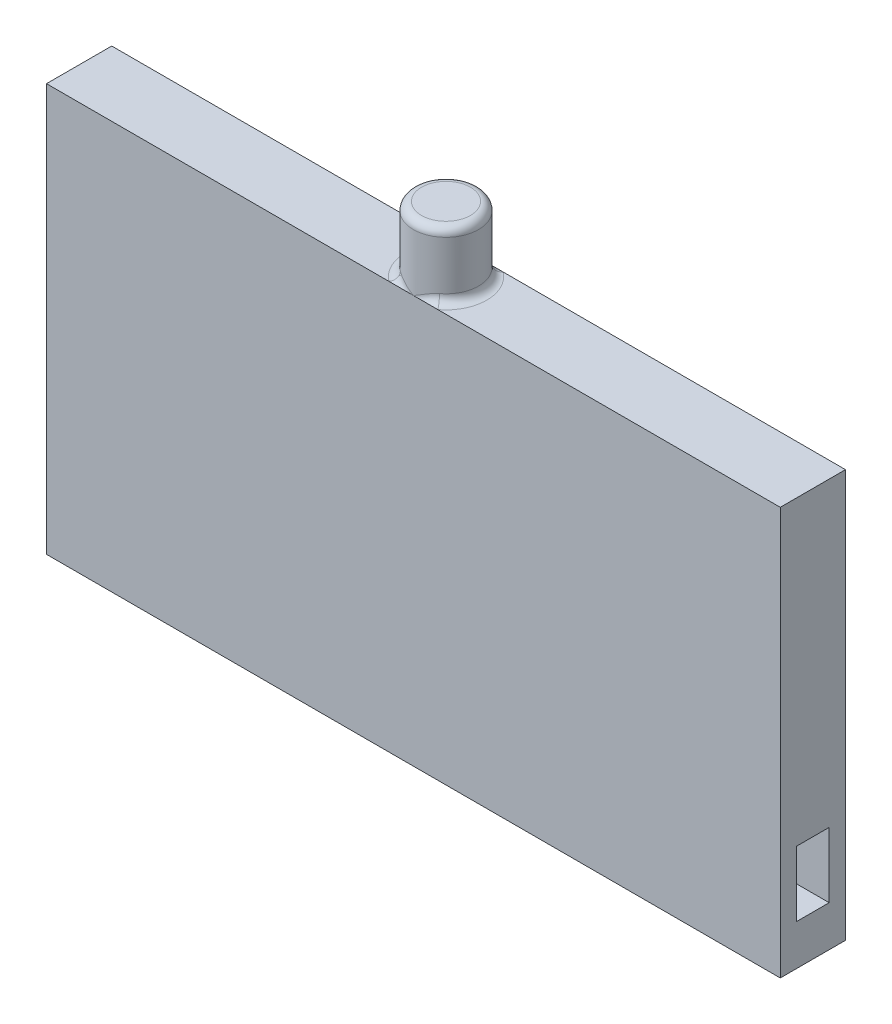
ISO-10303-21;
HEADER;
FILE_DESCRIPTION(('STEP AP214'),'2;1');
FILE_NAME('part.step','',(''),(''),'','','');
FILE_SCHEMA(('AUTOMOTIVE_DESIGN { 1 0 10303 214 1 1 1 1 }'));
ENDSEC;
DATA;
#1=APPLICATION_CONTEXT('core data for automotive mechanical design processes');
#2=APPLICATION_PROTOCOL_DEFINITION('international standard','automotive_design',2000,#1);
#3=PRODUCT_CONTEXT('',#1,'mechanical');
#4=PRODUCT('Part','Part','',(#3));
#5=PRODUCT_RELATED_PRODUCT_CATEGORY('part','',(#4));
#6=PRODUCT_DEFINITION_FORMATION('','',#4);
#7=PRODUCT_DEFINITION_CONTEXT('part definition',#1,'design');
#8=PRODUCT_DEFINITION('design','',#6,#7);
#9=PRODUCT_DEFINITION_SHAPE('','',#8);
#10=(LENGTH_UNIT() NAMED_UNIT(*) SI_UNIT(.MILLI.,.METRE.));
#11=(NAMED_UNIT(*) PLANE_ANGLE_UNIT() SI_UNIT($,.RADIAN.));
#12=(NAMED_UNIT(*) SI_UNIT($,.STERADIAN.) SOLID_ANGLE_UNIT());
#13=UNCERTAINTY_MEASURE_WITH_UNIT(LENGTH_MEASURE(1.E-05),#10,'distance_accuracy_value','');
#14=(GEOMETRIC_REPRESENTATION_CONTEXT(3) GLOBAL_UNCERTAINTY_ASSIGNED_CONTEXT((#13)) GLOBAL_UNIT_ASSIGNED_CONTEXT((#10,
#11,#12)) REPRESENTATION_CONTEXT('',''));
#15=CARTESIAN_POINT('',(0.,0.,0.));
#16=DIRECTION('',(0.,0.,1.));
#17=DIRECTION('',(1.,0.,0.));
#18=AXIS2_PLACEMENT_3D('',#15,#16,#17);
#19=CARTESIAN_POINT('',(0.,12.7,0.));
#20=DIRECTION('',(0.,-1.,0.));
#21=DIRECTION('',(0.,0.,-1.));
#22=AXIS2_PLACEMENT_3D('',#19,#20,#21);
#23=PLANE('',#22);
#24=DIRECTION('',(-1.,0.,0.));
#25=VECTOR('',#24,1.);
#26=CARTESIAN_POINT('',(-9.906,12.7,-15.7398333107177));
#27=LINE('',#26,#25);
#28=CARTESIAN_POINT('',(12.954,12.7,-15.7398333107177));
#29=VERTEX_POINT('',#28);
#30=CARTESIAN_POINT('',(2.286,12.7,-15.7398333107177));
#31=VERTEX_POINT('',#30);
#32=EDGE_CURVE('E190',#29,#31,#27,.T.);
#33=ORIENTED_EDGE('',*,*,#32,.T.);
#34=CARTESIAN_POINT('',(1.524,12.7,-14.7238333107177));
#35=DIRECTION('',(0.,-1.,0.));
#36=DIRECTION('',(0.,0.,-1.));
#37=AXIS2_PLACEMENT_3D('',#34,#35,#36);
#38=CIRCLE('',#37,1.27);
#39=CARTESIAN_POINT('',(2.286,12.7,-13.7078333107177));
#40=VERTEX_POINT('',#39);
#41=EDGE_CURVE('E11',#31,#40,#38,.T.);
#42=ORIENTED_EDGE('',*,*,#41,.T.);
#43=DIRECTION('',(1.,0.,0.));
#44=VECTOR('',#43,1.);
#45=CARTESIAN_POINT('',(-9.906,12.7,-13.7078333107177));
#46=LINE('',#45,#44);
#47=CARTESIAN_POINT('',(12.954,12.7,-13.7078333107177));
#48=VERTEX_POINT('',#47);
#49=EDGE_CURVE('E180',#40,#48,#46,.T.);
#50=ORIENTED_EDGE('',*,*,#49,.T.);
#51=DIRECTION('',(0.,0.,-1.));
#52=VECTOR('',#51,1.);
#53=CARTESIAN_POINT('',(12.954,12.7,-13.7078333107177));
#54=LINE('',#53,#52);
#55=EDGE_CURVE('E185',#48,#29,#54,.T.);
#56=ORIENTED_EDGE('',*,*,#55,.T.);
#57=EDGE_LOOP('',(#33,#42,#50,#56));
#58=FACE_BOUND('',#57,.T.);
#59=ADVANCED_FACE('F36',(#58),#23,.F.);
#60=CARTESIAN_POINT('',(-9.906,12.7,-13.7078333107177));
#61=DIRECTION('',(1.,0.,0.));
#62=DIRECTION('',(0.,0.,-1.));
#63=AXIS2_PLACEMENT_3D('',#60,#61,#62);
#64=PLANE('',#63);
#65=DIRECTION('',(0.,0.,1.));
#66=VECTOR('',#65,1.);
#67=CARTESIAN_POINT('',(-9.906,0.,-13.7078333107177));
#68=LINE('',#67,#66);
#69=CARTESIAN_POINT('',(-9.906,0.,-15.7398333107177));
#70=VERTEX_POINT('',#69);
#71=CARTESIAN_POINT('',(-9.906,0.,-13.7078333107177));
#72=VERTEX_POINT('',#71);
#73=EDGE_CURVE('E194',#70,#72,#68,.T.);
#74=ORIENTED_EDGE('',*,*,#73,.T.);
#75=DIRECTION('',(0.,-1.,0.));
#76=VECTOR('',#75,1.);
#77=CARTESIAN_POINT('',(-9.906,12.7,-13.7078333107177));
#78=LINE('',#77,#76);
#79=CARTESIAN_POINT('',(-9.906,12.7,-13.7078333107177));
#80=VERTEX_POINT('',#79);
#81=EDGE_CURVE('E211',#80,#72,#78,.T.);
#82=ORIENTED_EDGE('',*,*,#81,.F.);
#83=DIRECTION('',(0.,0.,1.));
#84=VECTOR('',#83,1.);
#85=CARTESIAN_POINT('',(-9.906,12.7,-13.7078333107177));
#86=LINE('',#85,#84);
#87=CARTESIAN_POINT('',(-9.906,12.7,-15.7398333107177));
#88=VERTEX_POINT('',#87);
#89=EDGE_CURVE('E177',#88,#80,#86,.T.);
#90=ORIENTED_EDGE('',*,*,#89,.F.);
#91=DIRECTION('',(0.,-1.,0.));
#92=VECTOR('',#91,1.);
#93=CARTESIAN_POINT('',(-9.906,12.7,-15.7398333107177));
#94=LINE('',#93,#92);
#95=EDGE_CURVE('E192',#88,#70,#94,.T.);
#96=ORIENTED_EDGE('',*,*,#95,.T.);
#97=EDGE_LOOP('',(#74,#82,#90,#96));
#98=FACE_BOUND('',#97,.T.);
#99=ADVANCED_FACE('F288',(#98),#64,.F.);
#100=CARTESIAN_POINT('',(-9.906,12.7,-13.7078333107177));
#101=DIRECTION('',(0.,0.,-1.));
#102=DIRECTION('',(-1.,0.,0.));
#103=AXIS2_PLACEMENT_3D('',#100,#101,#102);
#104=PLANE('',#103);
#105=DIRECTION('',(1.,0.,0.));
#106=VECTOR('',#105,1.);
#107=CARTESIAN_POINT('',(-9.906,0.,-13.7078333107177));
#108=LINE('',#107,#106);
#109=CARTESIAN_POINT('',(12.954,0.,-13.7078333107177));
#110=VERTEX_POINT('',#109);
#111=EDGE_CURVE('E197',#72,#110,#108,.T.);
#112=ORIENTED_EDGE('',*,*,#111,.T.);
#113=DIRECTION('',(0.,-1.,0.));
#114=VECTOR('',#113,1.);
#115=CARTESIAN_POINT('',(12.954,12.7,-13.7078333107177));
#116=LINE('',#115,#114);
#117=EDGE_CURVE('E208',#48,#110,#116,.T.);
#118=ORIENTED_EDGE('',*,*,#117,.F.);
#119=ORIENTED_EDGE('',*,*,#49,.F.);
#120=CARTESIAN_POINT('',(1.524,12.7,-13.7078333107177));
#121=VERTEX_POINT('',#120);
#122=EDGE_CURVE('E187',#121,#40,#46,.T.);
#123=ORIENTED_EDGE('',*,*,#122,.F.);
#124=CARTESIAN_POINT('',(0.762000000000002,12.7,-13.7078333107177));
#125=VERTEX_POINT('',#124);
#126=EDGE_CURVE('E186',#125,#121,#46,.T.);
#127=ORIENTED_EDGE('',*,*,#126,.F.);
#128=EDGE_CURVE('E182',#80,#125,#46,.T.);
#129=ORIENTED_EDGE('',*,*,#128,.F.);
#130=ORIENTED_EDGE('',*,*,#81,.T.);
#131=EDGE_LOOP('',(#112,#118,#119,#123,#127,#129,#130));
#132=FACE_BOUND('',#131,.T.);
#133=ADVANCED_FACE('F284',(#132),#104,.F.);
#134=CARTESIAN_POINT('',(12.954,12.7,-13.7078333107177));
#135=DIRECTION('',(-1.,0.,0.));
#136=DIRECTION('',(0.,0.,1.));
#137=AXIS2_PLACEMENT_3D('',#134,#135,#136);
#138=PLANE('',#137);
#139=DIRECTION('',(0.,0.,-1.));
#140=VECTOR('',#139,1.);
#141=CARTESIAN_POINT('',(12.954,1.27,-14.2158333107177));
#142=LINE('',#141,#140);
#143=CARTESIAN_POINT('',(12.954,1.27,-14.2158333107177));
#144=VERTEX_POINT('',#143);
#145=CARTESIAN_POINT('',(12.954,1.27,-15.2318333107177));
#146=VERTEX_POINT('',#145);
#147=EDGE_CURVE('E167',#144,#146,#142,.T.);
#148=ORIENTED_EDGE('',*,*,#147,.F.);
#149=DIRECTION('',(0.,-1.,0.));
#150=VECTOR('',#149,1.);
#151=CARTESIAN_POINT('',(12.954,1.27,-14.2158333107177));
#152=LINE('',#151,#150);
#153=CARTESIAN_POINT('',(12.954,3.302,-14.2158333107177));
#154=VERTEX_POINT('',#153);
#155=EDGE_CURVE('E57',#154,#144,#152,.T.);
#156=ORIENTED_EDGE('',*,*,#155,.F.);
#157=DIRECTION('',(0.,0.,1.));
#158=VECTOR('',#157,1.);
#159=CARTESIAN_POINT('',(12.954,3.302,-14.2158333107177));
#160=LINE('',#159,#158);
#161=CARTESIAN_POINT('',(12.954,3.302,-15.2318333107177));
#162=VERTEX_POINT('',#161);
#163=EDGE_CURVE('E158',#162,#154,#160,.T.);
#164=ORIENTED_EDGE('',*,*,#163,.F.);
#165=DIRECTION('',(0.,1.,0.));
#166=VECTOR('',#165,1.);
#167=CARTESIAN_POINT('',(12.954,1.27,-15.2318333107177));
#168=LINE('',#167,#166);
#169=EDGE_CURVE('E161',#146,#162,#168,.T.);
#170=ORIENTED_EDGE('',*,*,#169,.F.);
#171=EDGE_LOOP('',(#148,#156,#164,#170));
#172=FACE_BOUND('',#171,.T.);
#173=DIRECTION('',(0.,0.,-1.));
#174=VECTOR('',#173,1.);
#175=CARTESIAN_POINT('',(12.954,0.,-13.7078333107177));
#176=LINE('',#175,#174);
#177=CARTESIAN_POINT('',(12.954,0.,-15.7398333107177));
#178=VERTEX_POINT('',#177);
#179=EDGE_CURVE('E200',#110,#178,#176,.T.);
#180=ORIENTED_EDGE('',*,*,#179,.T.);
#181=DIRECTION('',(0.,-1.,0.));
#182=VECTOR('',#181,1.);
#183=CARTESIAN_POINT('',(12.954,12.7,-15.7398333107177));
#184=LINE('',#183,#182);
#185=EDGE_CURVE('E205',#29,#178,#184,.T.);
#186=ORIENTED_EDGE('',*,*,#185,.F.);
#187=ORIENTED_EDGE('',*,*,#55,.F.);
#188=ORIENTED_EDGE('',*,*,#117,.T.);
#189=EDGE_LOOP('',(#180,#186,#187,#188));
#190=FACE_BOUND('',#189,.T.);
#191=ADVANCED_FACE('F287',(#172,#190),#138,.F.);
#192=CARTESIAN_POINT('',(-9.906,12.7,-15.7398333107177));
#193=DIRECTION('',(0.,0.,1.));
#194=DIRECTION('',(1.,0.,0.));
#195=AXIS2_PLACEMENT_3D('',#192,#193,#194);
#196=PLANE('',#195);
#197=DIRECTION('',(-1.,0.,0.));
#198=VECTOR('',#197,1.);
#199=CARTESIAN_POINT('',(-9.906,0.,-15.7398333107177));
#200=LINE('',#199,#198);
#201=EDGE_CURVE('E181',#178,#70,#200,.T.);
#202=ORIENTED_EDGE('',*,*,#201,.T.);
#203=ORIENTED_EDGE('',*,*,#95,.F.);
#204=CARTESIAN_POINT('',(0.762000000000002,12.7,-15.7398333107177));
#205=VERTEX_POINT('',#204);
#206=EDGE_CURVE('E189',#205,#88,#27,.T.);
#207=ORIENTED_EDGE('',*,*,#206,.F.);
#208=CARTESIAN_POINT('',(1.524,12.7,-15.7398333107177));
#209=VERTEX_POINT('',#208);
#210=EDGE_CURVE('E193',#209,#205,#27,.T.);
#211=ORIENTED_EDGE('',*,*,#210,.F.);
#212=EDGE_CURVE('E65',#31,#209,#27,.T.);
#213=ORIENTED_EDGE('',*,*,#212,.F.);
#214=ORIENTED_EDGE('',*,*,#32,.F.);
#215=ORIENTED_EDGE('',*,*,#185,.T.);
#216=EDGE_LOOP('',(#202,#203,#207,#211,#213,#214,#215));
#217=FACE_BOUND('',#216,.T.);
#218=ADVANCED_FACE('F258',(#217),#196,.F.);
#219=ORIENTED_EDGE('',*,*,#128,.T.);
#220=CARTESIAN_POINT('',(1.524,12.7,-14.7238333107177));
#221=DIRECTION('',(0.,-1.,0.));
#222=DIRECTION('',(0.,0.,-1.));
#223=AXIS2_PLACEMENT_3D('',#220,#221,#222);
#224=CIRCLE('',#223,1.27);
#225=EDGE_CURVE('E49',#125,#205,#224,.T.);
#226=ORIENTED_EDGE('',*,*,#225,.T.);
#227=ORIENTED_EDGE('',*,*,#206,.T.);
#228=ORIENTED_EDGE('',*,*,#89,.T.);
#229=EDGE_LOOP('',(#219,#226,#227,#228));
#230=FACE_BOUND('',#229,.T.);
#231=ADVANCED_FACE('F255',(#230),#23,.F.);
#232=CARTESIAN_POINT('',(0.,0.,0.));
#233=DIRECTION('',(0.,-1.,0.));
#234=DIRECTION('',(0.,0.,-1.));
#235=AXIS2_PLACEMENT_3D('',#232,#233,#234);
#236=PLANE('',#235);
#237=ORIENTED_EDGE('',*,*,#73,.F.);
#238=ORIENTED_EDGE('',*,*,#201,.F.);
#239=ORIENTED_EDGE('',*,*,#179,.F.);
#240=ORIENTED_EDGE('',*,*,#111,.F.);
#241=EDGE_LOOP('',(#237,#238,#239,#240));
#242=FACE_BOUND('',#241,.T.);
#243=ADVANCED_FACE('F380',(#242),#236,.T.);
#244=CARTESIAN_POINT('',(1.524,14.732,-14.7238333107177));
#245=DIRECTION('',(0.,-1.,0.));
#246=DIRECTION('',(0.,0.,-1.));
#247=AXIS2_PLACEMENT_3D('',#244,#245,#246);
#248=CYLINDRICAL_SURFACE('',#247,1.016);
#249=CARTESIAN_POINT('',(1.524,14.478,-14.7238333107177));
#250=DIRECTION('',(0.,1.,0.));
#251=DIRECTION('',(0.,0.,1.));
#252=AXIS2_PLACEMENT_3D('',#249,#250,#251);
#253=CIRCLE('',#252,1.016);
#254=CARTESIAN_POINT('',(1.524,14.478,-13.7078333107177));
#255=VERTEX_POINT('',#254);
#256=EDGE_CURVE('E217',#255,#255,#253,.F.);
#257=ORIENTED_EDGE('',*,*,#256,.T.);
#258=EDGE_LOOP('',(#257));
#259=FACE_BOUND('',#258,.T.);
#260=CARTESIAN_POINT('',(2.22999399919304,12.9323092693618,-15.4544689744403));
#261=CARTESIAN_POINT('',(2.15762912961619,12.6047525616474,-15.5243932420477));
#262=CARTESIAN_POINT('',(2.4064924989913,12.7,-15.7398333107177));
#263=CARTESIAN_POINT('',(2.21539070176302,12.9400643662147,-15.4686076936029));
#264=CARTESIAN_POINT('',(2.16013043971291,12.6217760831303,-15.5193105706868));
#265=CARTESIAN_POINT('',(2.38823837720513,12.7,-15.7398333107177));
#266=CARTESIAN_POINT('',(2.20002251066382,12.9454546331779,-15.4825825451088));
#267=CARTESIAN_POINT('',(2.15898944492113,12.6391526553524,-15.5187327865888));
#268=CARTESIAN_POINT('',(2.36902813833045,12.7,-15.7398333107177));
#269=CARTESIAN_POINT('',(2.16829395448067,12.9523528845866,-15.5096839311462));
#270=CARTESIAN_POINT('',(2.1506264079769,12.6710582418321,-15.5237704354303));
#271=CARTESIAN_POINT('',(2.32936744310018,12.7,-15.7398333107177));
#272=CARTESIAN_POINT('',(2.15194579597119,12.9539013090713,-15.5228178720088));
#273=CARTESIAN_POINT('',(2.14378702017022,12.685768224025,-15.5289959824419));
#274=CARTESIAN_POINT('',(2.30893224496265,12.7,-15.7398333107177));
#275=CARTESIAN_POINT('',(2.10900747699933,12.9541429622308,-15.5551591211067));
#276=CARTESIAN_POINT('',(2.12080212618187,12.7179163845327,-15.5462268347036));
#277=CARTESIAN_POINT('',(2.25525934625124,12.7,-15.7398333107177));
#278=CARTESIAN_POINT('',(2.0818524305337,12.9507269739582,-15.573601893695));
#279=CARTESIAN_POINT('',(2.10163664566155,12.7335982565379,-15.5603817747969));
#280=CARTESIAN_POINT('',(2.22131553817615,12.7,-15.7398333107177));
#281=CARTESIAN_POINT('',(2.02626390275384,12.939025664532,-15.607609498478));
#282=CARTESIAN_POINT('',(2.05682597770893,12.75617974827,-15.5899736995301));
#283=CARTESIAN_POINT('',(2.15182987843322,12.7,-15.7398333107177));
#284=CARTESIAN_POINT('',(1.99782272973763,12.9307060312762,-15.6231530248784));
#285=CARTESIAN_POINT('',(2.03128975608147,12.7636517012701,-15.605494761524));
#286=CARTESIAN_POINT('',(2.11627841213767,12.7,-15.7398333107177));
#287=CARTESIAN_POINT('',(1.92328672816379,12.904866876462,-15.6594677944974));
#288=CARTESIAN_POINT('',(1.9614353813307,12.774387062972,-15.6428992688062));
#289=CARTESIAN_POINT('',(2.02310841025931,12.7,-15.7398333107177));
#290=CARTESIAN_POINT('',(1.87663894934852,12.8848140642996,-15.6779437854235));
#291=CARTESIAN_POINT('',(1.91305433596181,12.7738815954522,-15.6646704824849));
#292=CARTESIAN_POINT('',(1.96479868694514,12.7,-15.7398333107177));
#293=CARTESIAN_POINT('',(1.78258626727586,12.8402683605976,-15.7076154347474));
#294=CARTESIAN_POINT('',(1.81312650696352,12.7638351499827,-15.6996887709867));
#295=CARTESIAN_POINT('',(1.84723283436228,12.7,-15.7398333107177));
#296=CARTESIAN_POINT('',(1.73518191506025,12.8157785771441,-15.718816164421));
#297=CARTESIAN_POINT('',(1.76064846188578,12.7545968557819,-15.7137001602763));
#298=CARTESIAN_POINT('',(1.78797739389608,12.7,-15.7398333107177));
#299=CARTESIAN_POINT('',(1.63492660571583,12.7619811321778,-15.7351642232897));
#300=CARTESIAN_POINT('',(1.6495216086822,12.7311085861398,-15.733821241473));
#301=CARTESIAN_POINT('',(1.66265825706662,12.7,-15.7398333107177));
#302=CARTESIAN_POINT('',(1.58202795947278,12.7324377091468,-15.7395495368551));
#303=CARTESIAN_POINT('',(1.5893044812909,12.716222578597,-15.7394740322518));
#304=CARTESIAN_POINT('',(1.59653494933849,12.7,-15.7398333107177));
#305=CARTESIAN_POINT('',(1.52747000556191,12.7019397824138,-15.7398288607023));
#306=CARTESIAN_POINT('',(1.52790377917589,12.7009699098801,-15.7398278934925));
#307=CARTESIAN_POINT('',(1.52833750695247,12.7,-15.7398333107177));
#308=CARTESIAN_POINT('',(1.52573495587471,12.70096985959,-15.7398333042165));
#309=CARTESIAN_POINT('',(1.52595182230564,12.7004849426041,-15.7398334575026));
#310=CARTESIAN_POINT('',(1.52616869484347,12.7,-15.7398333107177));
#311=CARTESIAN_POINT('',(1.524,12.7,-15.7398333107177));
#312=CARTESIAN_POINT('',(1.524,12.7,-15.7398333107177));
#313=CARTESIAN_POINT('',(1.524,12.7,-15.7398333107177));
#314=(BOUNDED_SURFACE() B_SPLINE_SURFACE(3,2,((#260,#261,#262),(#263,#264,#265),(#266,#267,
#268),(#269,#270,#271),(#272,#273,#274),(#275,#276,#277),(#278,#279,#280),(#281,#282,#283),
(#284,#285,#286),(#287,#288,#289),(#290,#291,#292),(#293,#294,#295),(#296,#297,#298),(#299,#300,
#301),(#302,#303,#304),(#305,#306,#307),(#308,#309,#310),(#311,#312,#313)),.UNSPECIFIED.,.F.,
.F.,.F.) B_SPLINE_SURFACE_WITH_KNOTS((4,2,2,2,2,2,2,2,4),(3,3),(0.,0.0793252790118578,
0.157811952154223,0.280673172074431,0.404404464946702,0.600842987831006,0.797144434390673,
1.01412570681678,1.02125313817637),(0.,1.),
.UNSPECIFIED.) GEOMETRIC_REPRESENTATION_ITEM() RATIONAL_B_SPLINE_SURFACE(((1.,0.595490754317653,
1.),(1.,0.614138792536777,1.),(1.,0.632907033109889,1.),(1.,0.669779348387161,1.),(1.,
0.687888346908783,1.),(1.,0.73287636210131,1.),(1.,0.758925185024582,1.),(1.,0.807344062701329,
1.),(1.,0.829686758942298,1.),(1.,0.882140467793232,1.),(1.,0.909101389562458,1.),(1.,
0.952536676117571,1.),(1.,0.969018345376008,1.),(1.,0.993099717373105,1.),(1.,0.999580814566414,
1.),(1.,0.999993437605627,1.),(1.,0.999999998399152,1.),(1.,1.,1.))) REPRESENTATION_ITEM('') SURFACE());
#315=CARTESIAN_POINT('',(2.22999399919304,12.9323092693618,-15.4544689744403));
#316=CARTESIAN_POINT('',(2.21539070176302,12.9400643662147,-15.4686076936029));
#317=CARTESIAN_POINT('',(2.20002251066382,12.9454546331779,-15.4825825451088));
#318=CARTESIAN_POINT('',(2.16829395448067,12.9523528845866,-15.5096839311462));
#319=CARTESIAN_POINT('',(2.15194579597118,12.9539013090713,-15.5228178720088));
#320=CARTESIAN_POINT('',(2.10900747699933,12.9541429622308,-15.5551591211067));
#321=CARTESIAN_POINT('',(2.0818524305337,12.9507269739582,-15.573601893695));
#322=CARTESIAN_POINT('',(2.02626390275384,12.939025664532,-15.607609498478));
#323=CARTESIAN_POINT('',(1.99782272973763,12.9307060312762,-15.6231530248784));
#324=CARTESIAN_POINT('',(1.92328672816379,12.904866876462,-15.6594677944974));
#325=CARTESIAN_POINT('',(1.87663894934852,12.8848140642996,-15.6779437854235));
#326=CARTESIAN_POINT('',(1.78258626727586,12.8402683605976,-15.7076154347474));
#327=CARTESIAN_POINT('',(1.73518191506025,12.8157785771441,-15.718816164421));
#328=CARTESIAN_POINT('',(1.63492660571583,12.7619811321777,-15.7351642232897));
#329=CARTESIAN_POINT('',(1.58202795947279,12.7324377091468,-15.7395495368551));
#330=CARTESIAN_POINT('',(1.52747000556191,12.7019397824138,-15.7398288607023));
#331=CARTESIAN_POINT('',(1.5257349558747,12.70096985959,-15.7398333042165));
#332=CARTESIAN_POINT('',(1.524,12.7,-15.7398333107177));
#333=B_SPLINE_CURVE_WITH_KNOTS('',3,(#315,#316,#317,#318,#319,#320,#321,#322,#323,#324,#325,
#326,#327,#328,#329,#330,#331,#332),.UNSPECIFIED.,.F.,.F.,(4,2,2,2,2,2,2,2,4),(0.,
0.0793252790118578,0.157811952154223,0.280673172074431,0.404404464946702,0.600842987831006,
0.797144434390673,1.01412570681678,1.02125313817637),.UNSPECIFIED.);
#334=CARTESIAN_POINT('',(2.1336,12.954,-15.5366333107177));
#335=VERTEX_POINT('',#334);
#336=EDGE_CURVE('E220',#335,#209,#333,.T.);
#337=ORIENTED_EDGE('',*,*,#336,.T.);
#338=CARTESIAN_POINT('',(0.641507501008595,12.7,-15.7398333107177));
#339=CARTESIAN_POINT('',(0.890370870383829,12.6047525616473,-15.5243932420477));
#340=CARTESIAN_POINT('',(0.818006000806876,12.9323092693617,-15.4544689744402));
#341=CARTESIAN_POINT('',(0.659761622794754,12.7,-15.7398333107177));
#342=CARTESIAN_POINT('',(0.887869560287096,12.6217760831301,-15.5193105706868));
#343=CARTESIAN_POINT('',(0.832609298236888,12.9400643662146,-15.4686076936028));
#344=CARTESIAN_POINT('',(0.678971861669423,12.7,-15.7398333107177));
#345=CARTESIAN_POINT('',(0.889010555078859,12.6391526553522,-15.5187327865888));
#346=CARTESIAN_POINT('',(0.847977489336078,12.9454546331779,-15.4825825451087));
#347=CARTESIAN_POINT('',(0.718632556899669,12.7,-15.7398333107177));
#348=CARTESIAN_POINT('',(0.897373592023053,12.671058241832,-15.5237704354303));
#349=CARTESIAN_POINT('',(0.879706045519202,12.9523528845866,-15.5096839311461));
#350=CARTESIAN_POINT('',(0.739067755037179,12.7,-15.7398333107177));
#351=CARTESIAN_POINT('',(0.904212979829715,12.6857682240248,-15.5289959824419));
#352=CARTESIAN_POINT('',(0.896054204028682,12.9539013090713,-15.5228178720087));
#353=CARTESIAN_POINT('',(0.792740653748561,12.7,-15.7398333107177));
#354=CARTESIAN_POINT('',(0.927197873818024,12.7179163845326,-15.5462268347036));
#355=CARTESIAN_POINT('',(0.938992523000511,12.9541429622308,-15.5551591211065));
#356=CARTESIAN_POINT('',(0.826684461823625,12.7,-15.7398333107177));
#357=CARTESIAN_POINT('',(0.946363354338319,12.7335982565378,-15.5603817747968));
#358=CARTESIAN_POINT('',(0.966147569466119,12.9507269739582,-15.5736018936949));
#359=CARTESIAN_POINT('',(0.896170121566516,12.7,-15.7398333107177));
#360=CARTESIAN_POINT('',(0.991174022290886,12.7561797482699,-15.58997369953));
#361=CARTESIAN_POINT('',(1.02173609724594,12.939025664532,-15.6076094984778));
#362=CARTESIAN_POINT('',(0.931721587862042,12.7,-15.7398333107177));
#363=CARTESIAN_POINT('',(1.01671024391832,12.76365170127,-15.6054947615239));
#364=CARTESIAN_POINT('',(1.05017727026214,12.9307060312763,-15.6231530248783));
#365=CARTESIAN_POINT('',(1.02489158974034,12.7,-15.7398333107177));
#366=CARTESIAN_POINT('',(1.08656461866902,12.774387062972,-15.6428992688061));
#367=CARTESIAN_POINT('',(1.12471327183593,12.9048668764621,-15.6594677944973));
#368=CARTESIAN_POINT('',(1.08320131305448,12.7,-15.7398333107177));
#369=CARTESIAN_POINT('',(1.13494566403788,12.7738815954522,-15.6646704824848));
#370=CARTESIAN_POINT('',(1.17136105065118,12.8848140642998,-15.6779437854234));
#371=CARTESIAN_POINT('',(1.20076716563728,12.7,-15.7398333107177));
#372=CARTESIAN_POINT('',(1.2348734930361,12.7638351499827,-15.6996887709866));
#373=CARTESIAN_POINT('',(1.26541373272379,12.8402683605977,-15.7076154347473));
#374=CARTESIAN_POINT('',(1.26002260610345,12.7,-15.7398333107177));
#375=CARTESIAN_POINT('',(1.28735153811381,12.7545968557819,-15.7137001602762));
#376=CARTESIAN_POINT('',(1.31281808493937,12.8157785771443,-15.7188161644209));
#377=CARTESIAN_POINT('',(1.38534174293305,12.7,-15.7398333107177));
#378=CARTESIAN_POINT('',(1.39847839131749,12.7311085861399,-15.733821241473));
#379=CARTESIAN_POINT('',(1.4130733942839,12.7619811321779,-15.7351642232897));
#380=CARTESIAN_POINT('',(1.45146505066133,12.7,-15.7398333107177));
#381=CARTESIAN_POINT('',(1.45869551870895,12.7162225785971,-15.7394740322518));
#382=CARTESIAN_POINT('',(1.46597204052708,12.7324377091469,-15.7395495368551));
#383=CARTESIAN_POINT('',(1.51966249304753,12.7,-15.7398333107177));
#384=CARTESIAN_POINT('',(1.52009622082411,12.7009699098801,-15.7398278934925));
#385=CARTESIAN_POINT('',(1.52052999443809,12.7019397824138,-15.7398288607023));
#386=CARTESIAN_POINT('',(1.52183130515654,12.7,-15.7398333107177));
#387=CARTESIAN_POINT('',(1.52204817769436,12.7004849426041,-15.7398334575026));
#388=CARTESIAN_POINT('',(1.5222650441253,12.70096985959,-15.7398333042165));
#389=CARTESIAN_POINT('',(1.524,12.7,-15.7398333107177));
#390=CARTESIAN_POINT('',(1.524,12.7,-15.7398333107177));
#391=CARTESIAN_POINT('',(1.524,12.7,-15.7398333107177));
#392=(BOUNDED_SURFACE() B_SPLINE_SURFACE(3,2,((#338,#339,#340),(#341,#342,#343),(#344,#345,
#346),(#347,#348,#349),(#350,#351,#352),(#353,#354,#355),(#356,#357,#358),(#359,#360,#361),
(#362,#363,#364),(#365,#366,#367),(#368,#369,#370),(#371,#372,#373),(#374,#375,#376),(#377,#378,
#379),(#380,#381,#382),(#383,#384,#385),(#386,#387,#388),(#389,#390,#391)),.UNSPECIFIED.,.F.,
.F.,.F.) B_SPLINE_SURFACE_WITH_KNOTS((4,2,2,2,2,2,2,2,4),(3,3),(0.,0.0793252790118214,
0.157811952154154,0.280673172074297,0.404404464946499,0.600842987830704,0.797144434390273,
1.01412570681693,1.02125313817652),(0.,1.),
.UNSPECIFIED.) GEOMETRIC_REPRESENTATION_ITEM() RATIONAL_B_SPLINE_SURFACE(((1.,0.595490754317544,
1.),(1.,0.614138792536657,1.),(1.,0.63290703310976,1.),(1.,0.669779348387018,1.),(1.,
0.687888346908636,1.),(1.,0.73287636210115,1.),(1.,0.758925185024416,1.),(1.,0.807344062701154,
1.),(1.,0.82968675894212,1.),(1.,0.882140467793057,1.),(1.,0.909101389562292,1.),(1.,
0.952536676117432,1.),(1.,0.969018345375888,1.),(1.,0.993099717373071,1.),(1.,0.999580814566413,
1.),(1.,0.999993437605627,1.),(1.,0.999999998399152,1.),(1.,1.,1.))) REPRESENTATION_ITEM('') SURFACE());
#393=CARTESIAN_POINT('',(0.818006000806876,12.9323092693617,-15.4544689744402));
#394=CARTESIAN_POINT('',(0.832609298236888,12.9400643662146,-15.4686076936028));
#395=CARTESIAN_POINT('',(0.847977489336078,12.9454546331779,-15.4825825451087));
#396=CARTESIAN_POINT('',(0.879706045519202,12.9523528845866,-15.5096839311461));
#397=CARTESIAN_POINT('',(0.896054204028682,12.9539013090713,-15.5228178720087));
#398=CARTESIAN_POINT('',(0.938992523000511,12.9541429622308,-15.5551591211065));
#399=CARTESIAN_POINT('',(0.966147569466119,12.9507269739582,-15.5736018936949));
#400=CARTESIAN_POINT('',(1.02173609724594,12.939025664532,-15.6076094984778));
#401=CARTESIAN_POINT('',(1.05017727026214,12.9307060312763,-15.6231530248783));
#402=CARTESIAN_POINT('',(1.12471327183593,12.9048668764621,-15.6594677944973));
#403=CARTESIAN_POINT('',(1.17136105065118,12.8848140642998,-15.6779437854234));
#404=CARTESIAN_POINT('',(1.26541373272379,12.8402683605977,-15.7076154347473));
#405=CARTESIAN_POINT('',(1.31281808493937,12.8157785771443,-15.7188161644209));
#406=CARTESIAN_POINT('',(1.4130733942839,12.7619811321779,-15.7351642232897));
#407=CARTESIAN_POINT('',(1.46597204052708,12.7324377091469,-15.7395495368551));
#408=CARTESIAN_POINT('',(1.52052999443809,12.7019397824138,-15.7398288607023));
#409=CARTESIAN_POINT('',(1.5222650441253,12.70096985959,-15.7398333042165));
#410=CARTESIAN_POINT('',(1.524,12.7,-15.7398333107177));
#411=B_SPLINE_CURVE_WITH_KNOTS('',3,(#393,#394,#395,#396,#397,#398,#399,#400,#401,#402,#403,
#404,#405,#406,#407,#408,#409,#410),.UNSPECIFIED.,.F.,.F.,(4,2,2,2,2,2,2,2,4),(0.,
0.0793252790118214,0.157811952154154,0.280673172074297,0.404404464946499,0.600842987830704,
0.797144434390273,1.01412570681693,1.02125313817652),.UNSPECIFIED.);
#412=CARTESIAN_POINT('',(0.914400000000002,12.954,-15.5366333107177));
#413=VERTEX_POINT('',#412);
#414=EDGE_CURVE('E343',#209,#413,#411,.F.);
#415=ORIENTED_EDGE('',*,*,#414,.T.);
#416=CARTESIAN_POINT('',(1.524,12.954,-14.7238333107177));
#417=DIRECTION('',(0.,-1.,0.));
#418=DIRECTION('',(0.,0.,-1.));
#419=AXIS2_PLACEMENT_3D('',#416,#417,#418);
#420=CIRCLE('',#419,1.016);
#421=CARTESIAN_POINT('',(0.914400000000002,12.954,-13.9110333107177));
#422=VERTEX_POINT('',#421);
#423=EDGE_CURVE('E325',#413,#422,#420,.F.);
#424=ORIENTED_EDGE('',*,*,#423,.T.);
#425=CARTESIAN_POINT('',(0.818006000806964,12.9323092693618,-13.993197646995));
#426=CARTESIAN_POINT('',(0.890370870383815,12.6047525616474,-13.9232733793877));
#427=CARTESIAN_POINT('',(0.641507501008704,12.7,-13.7078333107177));
#428=CARTESIAN_POINT('',(0.832609298236986,12.9400643662147,-13.9790589278324));
#429=CARTESIAN_POINT('',(0.887869560287094,12.6217760831302,-13.9283560507486));
#430=CARTESIAN_POINT('',(0.659761622794876,12.7,-13.7078333107177));
#431=CARTESIAN_POINT('',(0.847977489336187,12.9454546331779,-13.9650840763265));
#432=CARTESIAN_POINT('',(0.889010555078872,12.6391526553524,-13.9289338348466));
#433=CARTESIAN_POINT('',(0.678971861669559,12.7,-13.7078333107177));
#434=CARTESIAN_POINT('',(0.879706045519332,12.9523528845866,-13.9379826902891));
#435=CARTESIAN_POINT('',(0.8973735920231,12.6710582418321,-13.9238961860051));
#436=CARTESIAN_POINT('',(0.718632556899832,12.7,-13.7078333107177));
#437=CARTESIAN_POINT('',(0.896054204028822,12.9539013090713,-13.9248487494266));
#438=CARTESIAN_POINT('',(0.90421297982978,12.685768224025,-13.9186706389934));
#439=CARTESIAN_POINT('',(0.739067755037355,12.7,-13.7078333107177));
#440=CARTESIAN_POINT('',(0.93899252300068,12.9541429622308,-13.8925075003287));
#441=CARTESIAN_POINT('',(0.927197873818133,12.7179163845328,-13.9014397867317));
#442=CARTESIAN_POINT('',(0.792740653748772,12.7,-13.7078333107177));
#443=CARTESIAN_POINT('',(0.966147569466305,12.9507269739582,-13.8740647277404));
#444=CARTESIAN_POINT('',(0.946363354338456,12.7335982565379,-13.8872848466385));
#445=CARTESIAN_POINT('',(0.826684461823858,12.7,-13.7078333107177));
#446=CARTESIAN_POINT('',(1.02173609724617,12.939025664532,-13.8400571229574));
#447=CARTESIAN_POINT('',(0.991174022291078,12.75617974827,-13.8576929219053));
#448=CARTESIAN_POINT('',(0.896170121566795,12.7,-13.7078333107177));
#449=CARTESIAN_POINT('',(1.05017727026238,12.9307060312762,-13.8245135965569));
#450=CARTESIAN_POINT('',(1.01671024391854,12.7636517012701,-13.8421718599114));
#451=CARTESIAN_POINT('',(0.931721587862345,12.7,-13.7078333107177));
#452=CARTESIAN_POINT('',(1.12471327183622,12.904866876462,-13.788198826938));
#453=CARTESIAN_POINT('',(1.08656461866931,12.7743870629721,-13.8047673526291));
#454=CARTESIAN_POINT('',(1.0248915897407,12.7,-13.7078333107177));
#455=CARTESIAN_POINT('',(1.1713610506515,12.8848140642996,-13.7697228360118));
#456=CARTESIAN_POINT('',(1.1349456640382,12.7738815954522,-13.7829961389504));
#457=CARTESIAN_POINT('',(1.08320131305487,12.7,-13.7078333107177));
#458=CARTESIAN_POINT('',(1.26541373272416,12.8402683605975,-13.740051186688));
#459=CARTESIAN_POINT('',(1.2348734930365,12.7638351499827,-13.7479778504487));
#460=CARTESIAN_POINT('',(1.20076716563774,12.7,-13.7078333107177));
#461=CARTESIAN_POINT('',(1.31281808493976,12.8157785771441,-13.7288504570144));
#462=CARTESIAN_POINT('',(1.28735153811424,12.7545968557819,-13.733966461159));
#463=CARTESIAN_POINT('',(1.26002260610394,12.7,-13.7078333107177));
#464=CARTESIAN_POINT('',(1.41307339428417,12.7619811321777,-13.7125023981457));
#465=CARTESIAN_POINT('',(1.39847839131781,12.7311085861398,-13.7138453799624));
#466=CARTESIAN_POINT('',(1.38534174293339,12.7,-13.7078333107177));
#467=CARTESIAN_POINT('',(1.46597204052721,12.7324377091468,-13.7081170845803));
#468=CARTESIAN_POINT('',(1.4586955187091,12.716222578597,-13.7081925891836));
#469=CARTESIAN_POINT('',(1.4514650506615,12.7,-13.7078333107177));
#470=CARTESIAN_POINT('',(1.52052999443809,12.7019397824138,-13.7078377607331));
#471=CARTESIAN_POINT('',(1.52009622082411,12.7009699098801,-13.7078387279428));
#472=CARTESIAN_POINT('',(1.51966249304753,12.7,-13.7078333107177));
#473=CARTESIAN_POINT('',(1.5222650441253,12.70096985959,-13.7078333172189));
#474=CARTESIAN_POINT('',(1.52204817769436,12.7004849426041,-13.7078331639328));
#475=CARTESIAN_POINT('',(1.52183130515654,12.7,-13.7078333107177));
#476=CARTESIAN_POINT('',(1.524,12.7,-13.7078333107177));
#477=CARTESIAN_POINT('',(1.524,12.7,-13.7078333107177));
#478=CARTESIAN_POINT('',(1.524,12.7,-13.7078333107177));
#479=(BOUNDED_SURFACE() B_SPLINE_SURFACE(3,2,((#425,#426,#427),(#428,#429,#430),(#431,#432,
#433),(#434,#435,#436),(#437,#438,#439),(#440,#441,#442),(#443,#444,#445),(#446,#447,#448),
(#449,#450,#451),(#452,#453,#454),(#455,#456,#457),(#458,#459,#460),(#461,#462,#463),(#464,#465,
#466),(#467,#468,#469),(#470,#471,#472),(#473,#474,#475),(#476,#477,#478)),.UNSPECIFIED.,.F.,
.F.,.F.) B_SPLINE_SURFACE_WITH_KNOTS((4,2,2,2,2,2,2,2,4),(3,3),(0.,0.0793252790118616,
0.15781195215423,0.28067317207444,0.404404464946713,0.600842987831021,0.797144434390689,
1.01412570681677,1.02125313817637),(0.,1.),
.UNSPECIFIED.) GEOMETRIC_REPRESENTATION_ITEM() RATIONAL_B_SPLINE_SURFACE(((1.,0.595490754317655,
1.),(1.,0.614138792536779,1.),(1.,0.632907033109892,1.),(1.,0.669779348387165,1.),(1.,
0.687888346908788,1.),(1.,0.732876362101316,1.),(1.,0.75892518502459,1.),(1.,0.807344062701337,
1.),(1.,0.829686758942304,1.),(1.,0.882140467793236,1.),(1.,0.909101389562463,1.),(1.,
0.952536676117575,1.),(1.,0.969018345376012,1.),(1.,0.993099717373106,1.),(1.,0.999580814566414,
1.),(1.,0.999993437605627,1.),(1.,0.999999998399152,1.),(1.,1.,1.))) REPRESENTATION_ITEM('') SURFACE());
#480=CARTESIAN_POINT('',(0.818006000806964,12.9323092693618,-13.993197646995));
#481=CARTESIAN_POINT('',(0.832609298236986,12.9400643662147,-13.9790589278324));
#482=CARTESIAN_POINT('',(0.847977489336187,12.9454546331779,-13.9650840763265));
#483=CARTESIAN_POINT('',(0.879706045519332,12.9523528845866,-13.9379826902891));
#484=CARTESIAN_POINT('',(0.896054204028822,12.9539013090713,-13.9248487494266));
#485=CARTESIAN_POINT('',(0.93899252300068,12.9541429622308,-13.8925075003287));
#486=CARTESIAN_POINT('',(0.966147569466305,12.9507269739582,-13.8740647277404));
#487=CARTESIAN_POINT('',(1.02173609724617,12.939025664532,-13.8400571229574));
#488=CARTESIAN_POINT('',(1.05017727026238,12.9307060312762,-13.8245135965569));
#489=CARTESIAN_POINT('',(1.12471327183622,12.904866876462,-13.788198826938));
#490=CARTESIAN_POINT('',(1.1713610506515,12.8848140642996,-13.7697228360118));
#491=CARTESIAN_POINT('',(1.26541373272416,12.8402683605975,-13.740051186688));
#492=CARTESIAN_POINT('',(1.31281808493976,12.8157785771441,-13.7288504570144));
#493=CARTESIAN_POINT('',(1.41307339428417,12.7619811321777,-13.7125023981457));
#494=CARTESIAN_POINT('',(1.46597204052721,12.7324377091468,-13.7081170845803));
#495=CARTESIAN_POINT('',(1.52052999443809,12.7019397824138,-13.7078377607331));
#496=CARTESIAN_POINT('',(1.5222650441253,12.70096985959,-13.7078333172189));
#497=CARTESIAN_POINT('',(1.524,12.7,-13.7078333107177));
#498=B_SPLINE_CURVE_WITH_KNOTS('',3,(#480,#481,#482,#483,#484,#485,#486,#487,#488,#489,#490,
#491,#492,#493,#494,#495,#496,#497),.UNSPECIFIED.,.F.,.F.,(4,2,2,2,2,2,2,2,4),(0.,
0.0793252790118616,0.15781195215423,0.28067317207444,0.404404464946713,0.600842987831021,
0.797144434390689,1.01412570681677,1.02125313817637),.UNSPECIFIED.);
#499=EDGE_CURVE('E324',#422,#121,#498,.T.);
#500=ORIENTED_EDGE('',*,*,#499,.T.);
#501=CARTESIAN_POINT('',(2.40649249899141,12.7,-13.7078333107177));
#502=CARTESIAN_POINT('',(2.15762912961617,12.6047525616473,-13.9232733793876));
#503=CARTESIAN_POINT('',(2.22999399919313,12.9323092693617,-13.9931976469951));
#504=CARTESIAN_POINT('',(2.38823837720525,12.7,-13.7078333107177));
#505=CARTESIAN_POINT('',(2.16013043971291,12.6217760831301,-13.9283560507486));
#506=CARTESIAN_POINT('',(2.21539070176311,12.9400643662146,-13.9790589278325));
#507=CARTESIAN_POINT('',(2.36902813833058,12.7,-13.7078333107177));
#508=CARTESIAN_POINT('',(2.15898944492114,12.6391526553522,-13.9289338348466));
#509=CARTESIAN_POINT('',(2.20002251066392,12.9454546331779,-13.9650840763266));
#510=CARTESIAN_POINT('',(2.32936744310033,12.7,-13.7078333107177));
#511=CARTESIAN_POINT('',(2.15062640797695,12.671058241832,-13.9238961860051));
#512=CARTESIAN_POINT('',(2.1682939544808,12.9523528845866,-13.9379826902892));
#513=CARTESIAN_POINT('',(2.30893224496282,12.7,-13.7078333107177));
#514=CARTESIAN_POINT('',(2.14378702017029,12.6857682240248,-13.9186706389935));
#515=CARTESIAN_POINT('',(2.15194579597132,12.9539013090713,-13.9248487494267));
#516=CARTESIAN_POINT('',(2.25525934625144,12.7,-13.7078333107177));
#517=CARTESIAN_POINT('',(2.12080212618198,12.7179163845326,-13.9014397867318));
#518=CARTESIAN_POINT('',(2.10900747699949,12.9541429622308,-13.8925075003288));
#519=CARTESIAN_POINT('',(2.22131553817638,12.7,-13.7078333107177));
#520=CARTESIAN_POINT('',(2.10163664566168,12.7335982565378,-13.8872848466386));
#521=CARTESIAN_POINT('',(2.08185243053389,12.9507269739582,-13.8740647277405));
#522=CARTESIAN_POINT('',(2.15182987843349,12.7,-13.7078333107177));
#523=CARTESIAN_POINT('',(2.05682597770912,12.7561797482699,-13.8576929219054));
#524=CARTESIAN_POINT('',(2.02626390275406,12.939025664532,-13.8400571229575));
#525=CARTESIAN_POINT('',(2.11627841213796,12.7,-13.7078333107177));
#526=CARTESIAN_POINT('',(2.03128975608169,12.76365170127,-13.8421718599115));
#527=CARTESIAN_POINT('',(1.99782272973787,12.9307060312763,-13.8245135965571));
#528=CARTESIAN_POINT('',(2.02310841025966,12.7,-13.7078333107177));
#529=CARTESIAN_POINT('',(1.96143538133098,12.774387062972,-13.8047673526293));
#530=CARTESIAN_POINT('',(1.92328672816407,12.9048668764621,-13.7881988269381));
#531=CARTESIAN_POINT('',(1.96479868694552,12.7,-13.7078333107177));
#532=CARTESIAN_POINT('',(1.91305433596213,12.7738815954522,-13.7829961389506));
#533=CARTESIAN_POINT('',(1.87663894934882,12.8848140642998,-13.7697228360119));
#534=CARTESIAN_POINT('',(1.84723283436272,12.7,-13.7078333107177));
#535=CARTESIAN_POINT('',(1.8131265069639,12.7638351499827,-13.7479778504488));
#536=CARTESIAN_POINT('',(1.78258626727621,12.8402683605977,-13.7400511866881));
#537=CARTESIAN_POINT('',(1.78797739389655,12.7,-13.7078333107177));
#538=CARTESIAN_POINT('',(1.76064846188619,12.7545968557819,-13.7339664611591));
#539=CARTESIAN_POINT('',(1.73518191506063,12.8157785771443,-13.7288504570145));
#540=CARTESIAN_POINT('',(1.66265825706696,12.7,-13.7078333107177));
#541=CARTESIAN_POINT('',(1.64952160868251,12.7311085861399,-13.7138453799624));
#542=CARTESIAN_POINT('',(1.63492660571611,12.7619811321779,-13.7125023981457));
#543=CARTESIAN_POINT('',(1.59653494933866,12.7,-13.7078333107177));
#544=CARTESIAN_POINT('',(1.58930448129105,12.7162225785971,-13.7081925891836));
#545=CARTESIAN_POINT('',(1.58202795947292,12.7324377091469,-13.7081170845803));
#546=CARTESIAN_POINT('',(1.52833750695247,12.7,-13.7078333107177));
#547=CARTESIAN_POINT('',(1.52790377917589,12.7009699098801,-13.7078387279428));
#548=CARTESIAN_POINT('',(1.52747000556191,12.7019397824138,-13.7078377607331));
#549=CARTESIAN_POINT('',(1.52616869484347,12.7,-13.7078333107177));
#550=CARTESIAN_POINT('',(1.52595182230564,12.7004849426041,-13.7078331639328));
#551=CARTESIAN_POINT('',(1.52573495587471,12.70096985959,-13.7078333172189));
#552=CARTESIAN_POINT('',(1.524,12.7,-13.7078333107177));
#553=CARTESIAN_POINT('',(1.524,12.7,-13.7078333107177));
#554=CARTESIAN_POINT('',(1.524,12.7,-13.7078333107177));
#555=(BOUNDED_SURFACE() B_SPLINE_SURFACE(3,2,((#501,#502,#503),(#504,#505,#506),(#507,#508,
#509),(#510,#511,#512),(#513,#514,#515),(#516,#517,#518),(#519,#520,#521),(#522,#523,#524),
(#525,#526,#527),(#528,#529,#530),(#531,#532,#533),(#534,#535,#536),(#537,#538,#539),(#540,#541,
#542),(#543,#544,#545),(#546,#547,#548),(#549,#550,#551),(#552,#553,#554)),.UNSPECIFIED.,.F.,
.F.,.F.) B_SPLINE_SURFACE_WITH_KNOTS((4,2,2,2,2,2,2,2,4),(3,3),(0.,0.0793252790118218,
0.157811952154152,0.280673172074292,0.404404464946496,0.600842987830705,0.797144434390273,
1.01412570681693,1.02125313817653),(0.,1.),
.UNSPECIFIED.) GEOMETRIC_REPRESENTATION_ITEM() RATIONAL_B_SPLINE_SURFACE(((1.,0.595490754317544,
1.),(1.,0.614138792536657,1.),(1.,0.63290703310976,1.),(1.,0.669779348387017,1.),(1.,
0.687888346908635,1.),(1.,0.732876362101147,1.),(1.,0.758925185024413,1.),(1.,0.807344062701151,
1.),(1.,0.829686758942118,1.),(1.,0.882140467793056,1.),(1.,0.909101389562292,1.),(1.,
0.952536676117432,1.),(1.,0.969018345375888,1.),(1.,0.993099717373071,1.),(1.,0.999580814566413,
1.),(1.,0.999993437605627,1.),(1.,0.999999998399152,1.),(1.,1.,1.))) REPRESENTATION_ITEM('') SURFACE());
#556=CARTESIAN_POINT('',(2.22999399919313,12.9323092693617,-13.9931976469951));
#557=CARTESIAN_POINT('',(2.21539070176311,12.9400643662146,-13.9790589278325));
#558=CARTESIAN_POINT('',(2.20002251066392,12.9454546331779,-13.9650840763266));
#559=CARTESIAN_POINT('',(2.1682939544808,12.9523528845866,-13.9379826902892));
#560=CARTESIAN_POINT('',(2.15194579597132,12.9539013090713,-13.9248487494267));
#561=CARTESIAN_POINT('',(2.10900747699949,12.9541429622308,-13.8925075003288));
#562=CARTESIAN_POINT('',(2.08185243053389,12.9507269739582,-13.8740647277405));
#563=CARTESIAN_POINT('',(2.02626390275406,12.939025664532,-13.8400571229575));
#564=CARTESIAN_POINT('',(1.99782272973787,12.9307060312763,-13.8245135965571));
#565=CARTESIAN_POINT('',(1.92328672816407,12.9048668764621,-13.7881988269381));
#566=CARTESIAN_POINT('',(1.87663894934882,12.8848140642998,-13.7697228360119));
#567=CARTESIAN_POINT('',(1.78258626727621,12.8402683605977,-13.7400511866881));
#568=CARTESIAN_POINT('',(1.73518191506063,12.8157785771443,-13.7288504570145));
#569=CARTESIAN_POINT('',(1.63492660571611,12.7619811321779,-13.7125023981457));
#570=CARTESIAN_POINT('',(1.58202795947292,12.7324377091469,-13.7081170845803));
#571=CARTESIAN_POINT('',(1.52747000556191,12.7019397824138,-13.7078377607331));
#572=CARTESIAN_POINT('',(1.52573495587471,12.70096985959,-13.7078333172189));
#573=CARTESIAN_POINT('',(1.524,12.7,-13.7078333107177));
#574=B_SPLINE_CURVE_WITH_KNOTS('',3,(#556,#557,#558,#559,#560,#561,#562,#563,#564,#565,#566,
#567,#568,#569,#570,#571,#572,#573),.UNSPECIFIED.,.F.,.F.,(4,2,2,2,2,2,2,2,4),(0.,
0.0793252790118218,0.157811952154152,0.280673172074292,0.404404464946496,0.600842987830705,
0.797144434390273,1.01412570681693,1.02125313817653),.UNSPECIFIED.);
#575=CARTESIAN_POINT('',(2.1336,12.954,-13.9110333107177));
#576=VERTEX_POINT('',#575);
#577=EDGE_CURVE('E316',#121,#576,#574,.F.);
#578=ORIENTED_EDGE('',*,*,#577,.T.);
#579=CARTESIAN_POINT('',(1.524,12.954,-14.7238333107177));
#580=DIRECTION('',(0.,-1.,0.));
#581=DIRECTION('',(0.,0.,-1.));
#582=AXIS2_PLACEMENT_3D('',#579,#580,#581);
#583=CIRCLE('',#582,1.016);
#584=EDGE_CURVE('E228',#576,#335,#583,.F.);
#585=ORIENTED_EDGE('',*,*,#584,.T.);
#586=EDGE_LOOP('',(#337,#415,#424,#500,#578,#585));
#587=FACE_BOUND('',#586,.T.);
#588=ADVANCED_FACE('F230',(#259,#587),#248,.T.);
#589=CARTESIAN_POINT('',(1.524,14.732,-14.7238333107177));
#590=DIRECTION('',(0.,1.,0.));
#591=DIRECTION('',(0.,0.,1.));
#592=AXIS2_PLACEMENT_3D('',#589,#590,#591);
#593=PLANE('',#592);
#594=CARTESIAN_POINT('',(1.524,14.732,-14.7238333107177));
#595=DIRECTION('',(0.,1.,0.));
#596=DIRECTION('',(0.,0.,1.));
#597=AXIS2_PLACEMENT_3D('',#594,#595,#596);
#598=CIRCLE('',#597,0.762);
#599=CARTESIAN_POINT('',(1.524,14.732,-13.9618333107177));
#600=VERTEX_POINT('',#599);
#601=EDGE_CURVE('E214',#600,#600,#598,.T.);
#602=ORIENTED_EDGE('',*,*,#601,.T.);
#603=EDGE_LOOP('',(#602));
#604=FACE_BOUND('',#603,.T.);
#605=ADVANCED_FACE('F427',(#604),#593,.T.);
#606=CARTESIAN_POINT('',(1.524,14.478,-14.7238333107177));
#607=DIRECTION('',(0.,1.,0.));
#608=DIRECTION('',(0.,0.,1.));
#609=AXIS2_PLACEMENT_3D('',#606,#607,#608);
#610=TOROIDAL_SURFACE('',#609,0.762,0.254);
#611=ORIENTED_EDGE('',*,*,#256,.F.);
#612=EDGE_LOOP('',(#611));
#613=FACE_BOUND('',#612,.T.);
#614=ORIENTED_EDGE('',*,*,#601,.F.);
#615=EDGE_LOOP('',(#614));
#616=FACE_BOUND('',#615,.T.);
#617=ADVANCED_FACE('F238',(#613,#616),#610,.T.);
#618=ORIENTED_EDGE('',*,*,#126,.T.);
#619=ORIENTED_EDGE('',*,*,#499,.F.);
#620=CARTESIAN_POINT('',(0.76200000000018,12.954,-13.7078333107176));
#621=DIRECTION('',(-0.800000000000105,3.15528443268148E-13,-0.59999999999986));
#622=DIRECTION('',(-0.59999999999986,0.,0.800000000000105));
#623=AXIS2_PLACEMENT_3D('',#620,#621,#622);
#624=CIRCLE('',#623,0.254);
#625=EDGE_CURVE('E198',#125,#422,#624,.F.);
#626=ORIENTED_EDGE('',*,*,#625,.F.);
#627=EDGE_LOOP('',(#618,#619,#626));
#628=FACE_BOUND('',#627,.T.);
#629=ADVANCED_FACE('F296',(#628),#479,.F.);
#630=CARTESIAN_POINT('',(1.524,12.954,-14.7238333107177));
#631=DIRECTION('',(0.,-1.,0.));
#632=DIRECTION('',(0.,0.,-1.));
#633=AXIS2_PLACEMENT_3D('',#630,#631,#632);
#634=TOROIDAL_SURFACE('',#633,1.27,0.254);
#635=ORIENTED_EDGE('',*,*,#625,.T.);
#636=ORIENTED_EDGE('',*,*,#423,.F.);
#637=CARTESIAN_POINT('',(0.762000000000002,12.954,-15.7398333107177));
#638=DIRECTION('',(-0.799999999999999,0.,0.600000000000001));
#639=DIRECTION('',(0.600000000000001,0.,0.799999999999999));
#640=AXIS2_PLACEMENT_3D('',#637,#638,#639);
#641=CIRCLE('',#640,0.254);
#642=EDGE_CURVE('E266',#205,#413,#641,.T.);
#643=ORIENTED_EDGE('',*,*,#642,.F.);
#644=ORIENTED_EDGE('',*,*,#225,.F.);
#645=EDGE_LOOP('',(#635,#636,#643,#644));
#646=FACE_BOUND('',#645,.T.);
#647=ADVANCED_FACE('F363',(#646),#634,.F.);
#648=ORIENTED_EDGE('',*,*,#414,.F.);
#649=ORIENTED_EDGE('',*,*,#210,.T.);
#650=ORIENTED_EDGE('',*,*,#642,.T.);
#651=EDGE_LOOP('',(#648,#649,#650));
#652=FACE_BOUND('',#651,.T.);
#653=ADVANCED_FACE('F249',(#652),#392,.F.);
#654=ORIENTED_EDGE('',*,*,#212,.T.);
#655=ORIENTED_EDGE('',*,*,#336,.F.);
#656=CARTESIAN_POINT('',(2.28599999999982,12.954,-15.7398333107178));
#657=DIRECTION('',(0.800000000000106,3.19626215258643E-13,0.599999999999859));
#658=DIRECTION('',(0.599999999999859,0.,-0.800000000000106));
#659=AXIS2_PLACEMENT_3D('',#656,#657,#658);
#660=CIRCLE('',#659,0.254);
#661=EDGE_CURVE('E263',#31,#335,#660,.F.);
#662=ORIENTED_EDGE('',*,*,#661,.F.);
#663=EDGE_LOOP('',(#654,#655,#662));
#664=FACE_BOUND('',#663,.T.);
#665=ADVANCED_FACE('F243',(#664),#314,.F.);
#666=CARTESIAN_POINT('',(1.524,12.954,-14.7238333107177));
#667=DIRECTION('',(0.,-1.,0.));
#668=DIRECTION('',(0.,0.,-1.));
#669=AXIS2_PLACEMENT_3D('',#666,#667,#668);
#670=TOROIDAL_SURFACE('',#669,1.27,0.254);
#671=ORIENTED_EDGE('',*,*,#661,.T.);
#672=ORIENTED_EDGE('',*,*,#584,.F.);
#673=CARTESIAN_POINT('',(2.286,12.954,-13.7078333107177));
#674=DIRECTION('',(0.800000000000001,0.,-0.599999999999999));
#675=DIRECTION('',(-0.599999999999999,0.,-0.800000000000001));
#676=AXIS2_PLACEMENT_3D('',#673,#674,#675);
#677=CIRCLE('',#676,0.254);
#678=EDGE_CURVE('E173',#40,#576,#677,.T.);
#679=ORIENTED_EDGE('',*,*,#678,.F.);
#680=ORIENTED_EDGE('',*,*,#41,.F.);
#681=EDGE_LOOP('',(#671,#672,#679,#680));
#682=FACE_BOUND('',#681,.T.);
#683=ADVANCED_FACE('F248',(#682),#670,.F.);
#684=ORIENTED_EDGE('',*,*,#577,.F.);
#685=ORIENTED_EDGE('',*,*,#122,.T.);
#686=ORIENTED_EDGE('',*,*,#678,.T.);
#687=EDGE_LOOP('',(#684,#685,#686));
#688=FACE_BOUND('',#687,.T.);
#689=ADVANCED_FACE('F281',(#688),#555,.F.);
#690=CARTESIAN_POINT('',(10.414,1.27,-14.2158333107177));
#691=DIRECTION('',(0.,0.,1.));
#692=DIRECTION('',(1.,0.,0.));
#693=AXIS2_PLACEMENT_3D('',#690,#691,#692);
#694=PLANE('',#693);
#695=ORIENTED_EDGE('',*,*,#155,.T.);
#696=DIRECTION('',(1.,0.,0.));
#697=VECTOR('',#696,1.);
#698=CARTESIAN_POINT('',(10.414,1.27,-14.2158333107177));
#699=LINE('',#698,#697);
#700=CARTESIAN_POINT('',(10.414,1.27,-14.2158333107177));
#701=VERTEX_POINT('',#700);
#702=EDGE_CURVE('E136',#701,#144,#699,.T.);
#703=ORIENTED_EDGE('',*,*,#702,.F.);
#704=DIRECTION('',(0.,-1.,0.));
#705=VECTOR('',#704,1.);
#706=CARTESIAN_POINT('',(10.414,1.27,-14.2158333107177));
#707=LINE('',#706,#705);
#708=CARTESIAN_POINT('',(10.414,3.302,-14.2158333107177));
#709=VERTEX_POINT('',#708);
#710=EDGE_CURVE('E140',#709,#701,#707,.T.);
#711=ORIENTED_EDGE('',*,*,#710,.F.);
#712=DIRECTION('',(1.,0.,0.));
#713=VECTOR('',#712,1.);
#714=CARTESIAN_POINT('',(10.414,3.302,-14.2158333107177));
#715=LINE('',#714,#713);
#716=EDGE_CURVE('E171',#709,#154,#715,.T.);
#717=ORIENTED_EDGE('',*,*,#716,.T.);
#718=EDGE_LOOP('',(#695,#703,#711,#717));
#719=FACE_BOUND('',#718,.T.);
#720=ADVANCED_FACE('F138',(#719),#694,.F.);
#721=CARTESIAN_POINT('',(10.414,3.302,-14.2158333107177));
#722=DIRECTION('',(0.,1.,0.));
#723=DIRECTION('',(0.,0.,1.));
#724=AXIS2_PLACEMENT_3D('',#721,#722,#723);
#725=PLANE('',#724);
#726=ORIENTED_EDGE('',*,*,#163,.T.);
#727=ORIENTED_EDGE('',*,*,#716,.F.);
#728=DIRECTION('',(0.,0.,1.));
#729=VECTOR('',#728,1.);
#730=CARTESIAN_POINT('',(10.414,3.302,-14.2158333107177));
#731=LINE('',#730,#729);
#732=CARTESIAN_POINT('',(10.414,3.302,-15.2318333107177));
#733=VERTEX_POINT('',#732);
#734=EDGE_CURVE('E146',#733,#709,#731,.T.);
#735=ORIENTED_EDGE('',*,*,#734,.F.);
#736=DIRECTION('',(1.,0.,0.));
#737=VECTOR('',#736,1.);
#738=CARTESIAN_POINT('',(10.414,3.302,-15.2318333107177));
#739=LINE('',#738,#737);
#740=EDGE_CURVE('E174',#733,#162,#739,.T.);
#741=ORIENTED_EDGE('',*,*,#740,.T.);
#742=EDGE_LOOP('',(#726,#727,#735,#741));
#743=FACE_BOUND('',#742,.T.);
#744=ADVANCED_FACE('F415',(#743),#725,.F.);
#745=CARTESIAN_POINT('',(10.414,1.27,-15.2318333107177));
#746=DIRECTION('',(0.,0.,-1.));
#747=DIRECTION('',(-1.,0.,0.));
#748=AXIS2_PLACEMENT_3D('',#745,#746,#747);
#749=PLANE('',#748);
#750=ORIENTED_EDGE('',*,*,#169,.T.);
#751=ORIENTED_EDGE('',*,*,#740,.F.);
#752=DIRECTION('',(0.,1.,0.));
#753=VECTOR('',#752,1.);
#754=CARTESIAN_POINT('',(10.414,1.27,-15.2318333107177));
#755=LINE('',#754,#753);
#756=CARTESIAN_POINT('',(10.414,1.27,-15.2318333107177));
#757=VERTEX_POINT('',#756);
#758=EDGE_CURVE('E154',#757,#733,#755,.T.);
#759=ORIENTED_EDGE('',*,*,#758,.F.);
#760=DIRECTION('',(1.,0.,0.));
#761=VECTOR('',#760,1.);
#762=CARTESIAN_POINT('',(10.414,1.27,-15.2318333107177));
#763=LINE('',#762,#761);
#764=EDGE_CURVE('E145',#757,#146,#763,.T.);
#765=ORIENTED_EDGE('',*,*,#764,.T.);
#766=EDGE_LOOP('',(#750,#751,#759,#765));
#767=FACE_BOUND('',#766,.T.);
#768=ADVANCED_FACE('F413',(#767),#749,.F.);
#769=CARTESIAN_POINT('',(10.414,1.27,-14.2158333107177));
#770=DIRECTION('',(0.,-1.,0.));
#771=DIRECTION('',(0.,0.,-1.));
#772=AXIS2_PLACEMENT_3D('',#769,#770,#771);
#773=PLANE('',#772);
#774=ORIENTED_EDGE('',*,*,#147,.T.);
#775=ORIENTED_EDGE('',*,*,#764,.F.);
#776=DIRECTION('',(0.,0.,-1.));
#777=VECTOR('',#776,1.);
#778=CARTESIAN_POINT('',(10.414,1.27,-14.2158333107177));
#779=LINE('',#778,#777);
#780=EDGE_CURVE('E149',#701,#757,#779,.T.);
#781=ORIENTED_EDGE('',*,*,#780,.F.);
#782=ORIENTED_EDGE('',*,*,#702,.T.);
#783=EDGE_LOOP('',(#774,#775,#781,#782));
#784=FACE_BOUND('',#783,.T.);
#785=ADVANCED_FACE('F150',(#784),#773,.F.);
#786=CARTESIAN_POINT('',(10.414,0.,0.));
#787=DIRECTION('',(-1.,0.,0.));
#788=DIRECTION('',(0.,0.,1.));
#789=AXIS2_PLACEMENT_3D('',#786,#787,#788);
#790=PLANE('',#789);
#791=ORIENTED_EDGE('',*,*,#710,.T.);
#792=ORIENTED_EDGE('',*,*,#780,.T.);
#793=ORIENTED_EDGE('',*,*,#758,.T.);
#794=ORIENTED_EDGE('',*,*,#734,.T.);
#795=EDGE_LOOP('',(#791,#792,#793,#794));
#796=FACE_BOUND('',#795,.T.);
#797=ADVANCED_FACE('F156',(#796),#790,.F.);
#798=CLOSED_SHELL('',(#59,#99,#133,#191,#218,#231,#243,#588,#605,#617,#629,#647,#653,#665,#683,
#689,#720,#744,#768,#785,#797));
#799=MANIFOLD_SOLID_BREP('B2',#798);
#800=ADVANCED_BREP_SHAPE_REPRESENTATION('',(#18,#799),#14);
#801=SHAPE_DEFINITION_REPRESENTATION(#9,#800);
ENDSEC;
END-ISO-10303-21;
